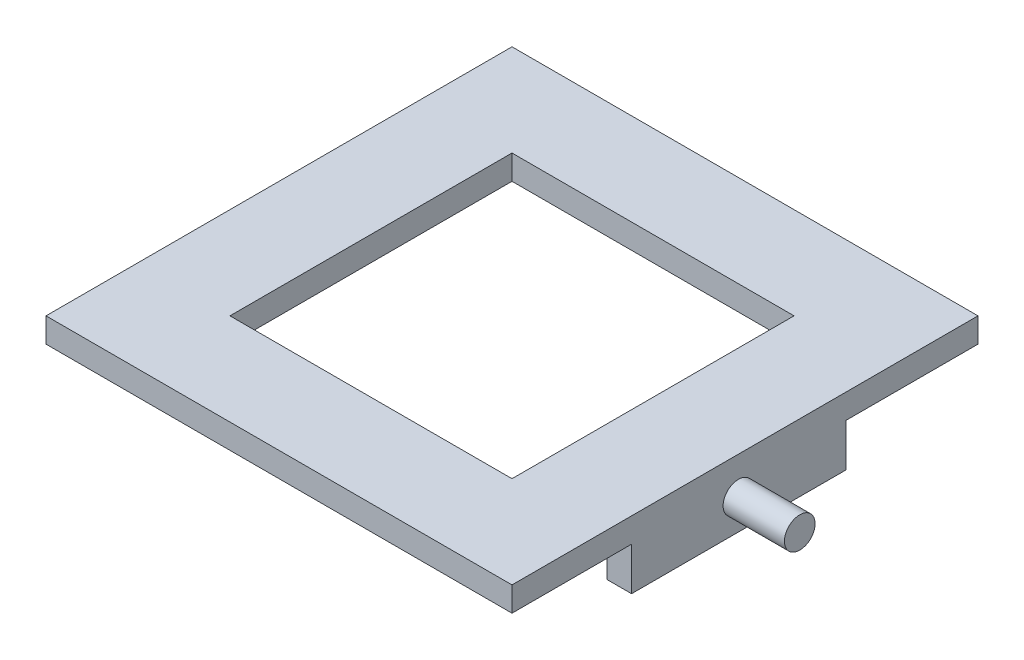
ISO-10303-21;
HEADER;
FILE_DESCRIPTION(('STEP AP214'),'2;1');
FILE_NAME('part.step','',(''),(''),'','','');
FILE_SCHEMA(('AUTOMOTIVE_DESIGN { 1 0 10303 214 1 1 1 1 }'));
ENDSEC;
DATA;
#1=APPLICATION_CONTEXT('core data for automotive mechanical design processes');
#2=APPLICATION_PROTOCOL_DEFINITION('international standard','automotive_design',2000,#1);
#3=PRODUCT_CONTEXT('',#1,'mechanical');
#4=PRODUCT('Part','Part','',(#3));
#5=PRODUCT_RELATED_PRODUCT_CATEGORY('part','',(#4));
#6=PRODUCT_DEFINITION_FORMATION('','',#4);
#7=PRODUCT_DEFINITION_CONTEXT('part definition',#1,'design');
#8=PRODUCT_DEFINITION('design','',#6,#7);
#9=PRODUCT_DEFINITION_SHAPE('','',#8);
#10=(LENGTH_UNIT() NAMED_UNIT(*) SI_UNIT(.MILLI.,.METRE.));
#11=(NAMED_UNIT(*) PLANE_ANGLE_UNIT() SI_UNIT($,.RADIAN.));
#12=(NAMED_UNIT(*) SI_UNIT($,.STERADIAN.) SOLID_ANGLE_UNIT());
#13=UNCERTAINTY_MEASURE_WITH_UNIT(LENGTH_MEASURE(1.E-05),#10,'distance_accuracy_value','');
#14=(GEOMETRIC_REPRESENTATION_CONTEXT(3) GLOBAL_UNCERTAINTY_ASSIGNED_CONTEXT((#13)) GLOBAL_UNIT_ASSIGNED_CONTEXT((#10,
#11,#12)) REPRESENTATION_CONTEXT('',''));
#15=CARTESIAN_POINT('',(0.,0.,0.));
#16=DIRECTION('',(0.,0.,1.));
#17=DIRECTION('',(1.,0.,0.));
#18=AXIS2_PLACEMENT_3D('',#15,#16,#17);
#19=CARTESIAN_POINT('',(0.,4.,0.));
#20=DIRECTION('',(0.,-1.,0.));
#21=DIRECTION('',(0.,0.,-1.));
#22=AXIS2_PLACEMENT_3D('',#19,#20,#21);
#23=PLANE('',#22);
#24=DIRECTION('',(0.,0.,-1.));
#25=VECTOR('',#24,1.);
#26=CARTESIAN_POINT('',(76.,4.,0.));
#27=LINE('',#26,#25);
#28=CARTESIAN_POINT('',(76.,4.,0.));
#29=VERTEX_POINT('',#28);
#30=CARTESIAN_POINT('',(76.,4.,-76.));
#31=VERTEX_POINT('',#30);
#32=EDGE_CURVE('E250',#29,#31,#27,.T.);
#33=ORIENTED_EDGE('',*,*,#32,.T.);
#34=DIRECTION('',(-1.,0.,0.));
#35=VECTOR('',#34,1.);
#36=CARTESIAN_POINT('',(0.,4.,-76.));
#37=LINE('',#36,#35);
#38=CARTESIAN_POINT('',(0.,4.,-76.));
#39=VERTEX_POINT('',#38);
#40=EDGE_CURVE('E252',#31,#39,#37,.T.);
#41=ORIENTED_EDGE('',*,*,#40,.T.);
#42=DIRECTION('',(0.,0.,1.));
#43=VECTOR('',#42,1.);
#44=CARTESIAN_POINT('',(0.,4.,0.));
#45=LINE('',#44,#43);
#46=CARTESIAN_POINT('',(0.,4.,0.));
#47=VERTEX_POINT('',#46);
#48=EDGE_CURVE('E245',#39,#47,#45,.T.);
#49=ORIENTED_EDGE('',*,*,#48,.T.);
#50=DIRECTION('',(1.,0.,0.));
#51=VECTOR('',#50,1.);
#52=CARTESIAN_POINT('',(0.,4.,0.));
#53=LINE('',#52,#51);
#54=EDGE_CURVE('E247',#47,#29,#53,.T.);
#55=ORIENTED_EDGE('',*,*,#54,.T.);
#56=EDGE_LOOP('',(#33,#41,#49,#55));
#57=FACE_BOUND('',#56,.T.);
#58=DIRECTION('',(1.,0.,0.));
#59=VECTOR('',#58,1.);
#60=CARTESIAN_POINT('',(15.,4.,-15.));
#61=LINE('',#60,#59);
#62=CARTESIAN_POINT('',(15.,4.,-15.));
#63=VERTEX_POINT('',#62);
#64=CARTESIAN_POINT('',(61.,4.,-15.));
#65=VERTEX_POINT('',#64);
#66=EDGE_CURVE('E214',#63,#65,#61,.T.);
#67=ORIENTED_EDGE('',*,*,#66,.F.);
#68=DIRECTION('',(0.,0.,1.));
#69=VECTOR('',#68,1.);
#70=CARTESIAN_POINT('',(15.,4.,-15.));
#71=LINE('',#70,#69);
#72=CARTESIAN_POINT('',(15.,4.,-61.));
#73=VERTEX_POINT('',#72);
#74=EDGE_CURVE('E222',#73,#63,#71,.T.);
#75=ORIENTED_EDGE('',*,*,#74,.F.);
#76=DIRECTION('',(-1.,0.,0.));
#77=VECTOR('',#76,1.);
#78=CARTESIAN_POINT('',(15.,4.,-61.));
#79=LINE('',#78,#77);
#80=CARTESIAN_POINT('',(61.,4.,-61.));
#81=VERTEX_POINT('',#80);
#82=EDGE_CURVE('E219',#81,#73,#79,.T.);
#83=ORIENTED_EDGE('',*,*,#82,.F.);
#84=DIRECTION('',(0.,0.,-1.));
#85=VECTOR('',#84,1.);
#86=CARTESIAN_POINT('',(61.,4.,-15.));
#87=LINE('',#86,#85);
#88=EDGE_CURVE('E216',#65,#81,#87,.T.);
#89=ORIENTED_EDGE('',*,*,#88,.F.);
#90=EDGE_LOOP('',(#67,#75,#83,#89));
#91=FACE_BOUND('',#90,.T.);
#92=ADVANCED_FACE('F35',(#57,#91),#23,.F.);
#93=CARTESIAN_POINT('',(0.,0.,0.));
#94=DIRECTION('',(0.,-1.,0.));
#95=DIRECTION('',(0.,0.,-1.));
#96=AXIS2_PLACEMENT_3D('',#93,#94,#95);
#97=PLANE('',#96);
#98=DIRECTION('',(-1.,0.,0.));
#99=VECTOR('',#98,1.);
#100=CARTESIAN_POINT('',(0.,0.,-19.5));
#101=LINE('',#100,#99);
#102=CARTESIAN_POINT('',(76.,0.,-19.5));
#103=VERTEX_POINT('',#102);
#104=CARTESIAN_POINT('',(72.,0.,-19.5));
#105=VERTEX_POINT('',#104);
#106=EDGE_CURVE('E156',#103,#105,#101,.T.);
#107=ORIENTED_EDGE('',*,*,#106,.F.);
#108=DIRECTION('',(0.,0.,-1.));
#109=VECTOR('',#108,1.);
#110=CARTESIAN_POINT('',(76.,0.,0.));
#111=LINE('',#110,#109);
#112=CARTESIAN_POINT('',(76.,0.,0.));
#113=VERTEX_POINT('',#112);
#114=EDGE_CURVE('E261',#113,#103,#111,.T.);
#115=ORIENTED_EDGE('',*,*,#114,.F.);
#116=DIRECTION('',(1.,0.,0.));
#117=VECTOR('',#116,1.);
#118=CARTESIAN_POINT('',(0.,0.,0.));
#119=LINE('',#118,#117);
#120=CARTESIAN_POINT('',(0.,0.,0.));
#121=VERTEX_POINT('',#120);
#122=EDGE_CURVE('E258',#121,#113,#119,.T.);
#123=ORIENTED_EDGE('',*,*,#122,.F.);
#124=DIRECTION('',(0.,0.,1.));
#125=VECTOR('',#124,1.);
#126=CARTESIAN_POINT('',(0.,0.,0.));
#127=LINE('',#126,#125);
#128=CARTESIAN_POINT('',(0.,0.,-19.5));
#129=VERTEX_POINT('',#128);
#130=EDGE_CURVE('E244',#129,#121,#127,.T.);
#131=ORIENTED_EDGE('',*,*,#130,.F.);
#132=DIRECTION('',(-1.,0.,0.));
#133=VECTOR('',#132,1.);
#134=CARTESIAN_POINT('',(0.,0.,-19.5));
#135=LINE('',#134,#133);
#136=CARTESIAN_POINT('',(4.,0.,-19.5));
#137=VERTEX_POINT('',#136);
#138=EDGE_CURVE('E207',#137,#129,#135,.T.);
#139=ORIENTED_EDGE('',*,*,#138,.F.);
#140=DIRECTION('',(0.,0.,-1.));
#141=VECTOR('',#140,1.);
#142=CARTESIAN_POINT('',(4.,0.,0.));
#143=LINE('',#142,#141);
#144=CARTESIAN_POINT('',(4.,0.,-54.5));
#145=VERTEX_POINT('',#144);
#146=EDGE_CURVE('E276',#137,#145,#143,.T.);
#147=ORIENTED_EDGE('',*,*,#146,.T.);
#148=DIRECTION('',(1.,0.,0.));
#149=VECTOR('',#148,1.);
#150=CARTESIAN_POINT('',(0.,0.,-54.5));
#151=LINE('',#150,#149);
#152=CARTESIAN_POINT('',(0.,0.,-54.5));
#153=VERTEX_POINT('',#152);
#154=EDGE_CURVE('E211',#153,#145,#151,.T.);
#155=ORIENTED_EDGE('',*,*,#154,.F.);
#156=CARTESIAN_POINT('',(0.,0.,-76.));
#157=VERTEX_POINT('',#156);
#158=EDGE_CURVE('E255',#157,#153,#127,.T.);
#159=ORIENTED_EDGE('',*,*,#158,.F.);
#160=DIRECTION('',(-1.,0.,0.));
#161=VECTOR('',#160,1.);
#162=CARTESIAN_POINT('',(0.,0.,-76.));
#163=LINE('',#162,#161);
#164=CARTESIAN_POINT('',(76.,0.,-76.));
#165=VERTEX_POINT('',#164);
#166=EDGE_CURVE('E248',#165,#157,#163,.T.);
#167=ORIENTED_EDGE('',*,*,#166,.F.);
#168=CARTESIAN_POINT('',(76.,0.,-54.5));
#169=VERTEX_POINT('',#168);
#170=EDGE_CURVE('E260',#169,#165,#111,.T.);
#171=ORIENTED_EDGE('',*,*,#170,.F.);
#172=DIRECTION('',(1.,0.,0.));
#173=VECTOR('',#172,1.);
#174=CARTESIAN_POINT('',(0.,0.,-54.5));
#175=LINE('',#174,#173);
#176=CARTESIAN_POINT('',(72.,0.,-54.5));
#177=VERTEX_POINT('',#176);
#178=EDGE_CURVE('E181',#177,#169,#175,.T.);
#179=ORIENTED_EDGE('',*,*,#178,.F.);
#180=DIRECTION('',(0.,0.,-1.));
#181=VECTOR('',#180,1.);
#182=CARTESIAN_POINT('',(72.,0.,0.));
#183=LINE('',#182,#181);
#184=EDGE_CURVE('E43',#105,#177,#183,.T.);
#185=ORIENTED_EDGE('',*,*,#184,.F.);
#186=EDGE_LOOP('',(#107,#115,#123,#131,#139,#147,#155,#159,#167,#171,#179,#185));
#187=FACE_BOUND('',#186,.T.);
#188=DIRECTION('',(0.,0.,1.));
#189=VECTOR('',#188,1.);
#190=CARTESIAN_POINT('',(15.,0.,-15.));
#191=LINE('',#190,#189);
#192=CARTESIAN_POINT('',(15.,0.,-61.));
#193=VERTEX_POINT('',#192);
#194=CARTESIAN_POINT('',(15.,0.,-15.));
#195=VERTEX_POINT('',#194);
#196=EDGE_CURVE('E217',#193,#195,#191,.T.);
#197=ORIENTED_EDGE('',*,*,#196,.T.);
#198=DIRECTION('',(1.,0.,0.));
#199=VECTOR('',#198,1.);
#200=CARTESIAN_POINT('',(15.,0.,-15.));
#201=LINE('',#200,#199);
#202=CARTESIAN_POINT('',(61.,0.,-15.));
#203=VERTEX_POINT('',#202);
#204=EDGE_CURVE('E213',#195,#203,#201,.T.);
#205=ORIENTED_EDGE('',*,*,#204,.T.);
#206=DIRECTION('',(0.,0.,-1.));
#207=VECTOR('',#206,1.);
#208=CARTESIAN_POINT('',(61.,0.,-15.));
#209=LINE('',#208,#207);
#210=CARTESIAN_POINT('',(61.,0.,-61.));
#211=VERTEX_POINT('',#210);
#212=EDGE_CURVE('E227',#203,#211,#209,.T.);
#213=ORIENTED_EDGE('',*,*,#212,.T.);
#214=DIRECTION('',(-1.,0.,0.));
#215=VECTOR('',#214,1.);
#216=CARTESIAN_POINT('',(15.,0.,-61.));
#217=LINE('',#216,#215);
#218=EDGE_CURVE('E230',#211,#193,#217,.T.);
#219=ORIENTED_EDGE('',*,*,#218,.T.);
#220=EDGE_LOOP('',(#197,#205,#213,#219));
#221=FACE_BOUND('',#220,.T.);
#222=ADVANCED_FACE('F289',(#187,#221),#97,.T.);
#223=CARTESIAN_POINT('',(0.,4.,0.));
#224=DIRECTION('',(1.,0.,0.));
#225=DIRECTION('',(0.,0.,-1.));
#226=AXIS2_PLACEMENT_3D('',#223,#224,#225);
#227=PLANE('',#226);
#228=CARTESIAN_POINT('',(0.,-2.05999999999999,-22.55));
#229=DIRECTION('',(1.,0.,0.));
#230=DIRECTION('',(0.,0.,-1.));
#231=AXIS2_PLACEMENT_3D('',#228,#229,#230);
#232=CIRCLE('',#231,0.6);
#233=CARTESIAN_POINT('',(0.,-2.05999999999999,-23.15));
#234=VERTEX_POINT('',#233);
#235=EDGE_CURVE('E282',#234,#234,#232,.F.);
#236=ORIENTED_EDGE('',*,*,#235,.F.);
#237=EDGE_LOOP('',(#236));
#238=FACE_BOUND('',#237,.T.);
#239=CARTESIAN_POINT('',(0.,-2.06,-51.45));
#240=DIRECTION('',(1.,0.,0.));
#241=DIRECTION('',(0.,0.,-1.));
#242=AXIS2_PLACEMENT_3D('',#239,#240,#241);
#243=CIRCLE('',#242,0.600000000000001);
#244=CARTESIAN_POINT('',(0.,-2.06,-52.05));
#245=VERTEX_POINT('',#244);
#246=EDGE_CURVE('E279',#245,#245,#243,.F.);
#247=ORIENTED_EDGE('',*,*,#246,.F.);
#248=EDGE_LOOP('',(#247));
#249=FACE_BOUND('',#248,.T.);
#250=DIRECTION('',(0.,-1.,0.));
#251=VECTOR('',#250,1.);
#252=CARTESIAN_POINT('',(0.,4.,0.));
#253=LINE('',#252,#251);
#254=EDGE_CURVE('E273',#47,#121,#253,.T.);
#255=ORIENTED_EDGE('',*,*,#254,.F.);
#256=ORIENTED_EDGE('',*,*,#48,.F.);
#257=DIRECTION('',(0.,-1.,0.));
#258=VECTOR('',#257,1.);
#259=CARTESIAN_POINT('',(0.,4.,-76.));
#260=LINE('',#259,#258);
#261=EDGE_CURVE('E254',#39,#157,#260,.T.);
#262=ORIENTED_EDGE('',*,*,#261,.T.);
#263=ORIENTED_EDGE('',*,*,#158,.T.);
#264=DIRECTION('',(0.,-1.,0.));
#265=VECTOR('',#264,1.);
#266=CARTESIAN_POINT('',(0.,4.,-54.5));
#267=LINE('',#266,#265);
#268=CARTESIAN_POINT('',(0.,-7.,-54.5));
#269=VERTEX_POINT('',#268);
#270=EDGE_CURVE('E191',#153,#269,#267,.T.);
#271=ORIENTED_EDGE('',*,*,#270,.T.);
#272=DIRECTION('',(0.,0.,1.));
#273=VECTOR('',#272,1.);
#274=CARTESIAN_POINT('',(0.,-7.,-54.5));
#275=LINE('',#274,#273);
#276=CARTESIAN_POINT('',(0.,-7.,-19.5));
#277=VERTEX_POINT('',#276);
#278=EDGE_CURVE('E202',#269,#277,#275,.T.);
#279=ORIENTED_EDGE('',*,*,#278,.T.);
#280=DIRECTION('',(0.,1.,0.));
#281=VECTOR('',#280,1.);
#282=CARTESIAN_POINT('',(0.,4.,-19.5));
#283=LINE('',#282,#281);
#284=EDGE_CURVE('E58',#277,#129,#283,.T.);
#285=ORIENTED_EDGE('',*,*,#284,.T.);
#286=ORIENTED_EDGE('',*,*,#130,.T.);
#287=EDGE_LOOP('',(#255,#256,#262,#263,#271,#279,#285,#286));
#288=FACE_BOUND('',#287,.T.);
#289=ADVANCED_FACE('F37',(#238,#249,#288),#227,.F.);
#290=CARTESIAN_POINT('',(0.,4.,0.));
#291=DIRECTION('',(0.,0.,-1.));
#292=DIRECTION('',(-1.,0.,0.));
#293=AXIS2_PLACEMENT_3D('',#290,#291,#292);
#294=PLANE('',#293);
#295=ORIENTED_EDGE('',*,*,#122,.T.);
#296=DIRECTION('',(0.,-1.,0.));
#297=VECTOR('',#296,1.);
#298=CARTESIAN_POINT('',(76.,4.,0.));
#299=LINE('',#298,#297);
#300=EDGE_CURVE('E270',#29,#113,#299,.T.);
#301=ORIENTED_EDGE('',*,*,#300,.F.);
#302=ORIENTED_EDGE('',*,*,#54,.F.);
#303=ORIENTED_EDGE('',*,*,#254,.T.);
#304=EDGE_LOOP('',(#295,#301,#302,#303));
#305=FACE_BOUND('',#304,.T.);
#306=ADVANCED_FACE('F311',(#305),#294,.F.);
#307=CARTESIAN_POINT('',(76.,4.,0.));
#308=DIRECTION('',(-1.,0.,0.));
#309=DIRECTION('',(0.,0.,1.));
#310=AXIS2_PLACEMENT_3D('',#307,#308,#309);
#311=PLANE('',#310);
#312=CARTESIAN_POINT('',(76.,-2.06,-36.93));
#313=DIRECTION('',(-1.,0.,0.));
#314=DIRECTION('',(0.,0.,1.));
#315=AXIS2_PLACEMENT_3D('',#312,#313,#314);
#316=CIRCLE('',#315,2.5);
#317=CARTESIAN_POINT('',(76.,-2.06,-34.43));
#318=VERTEX_POINT('',#317);
#319=EDGE_CURVE('E11',#318,#318,#316,.F.);
#320=ORIENTED_EDGE('',*,*,#319,.F.);
#321=EDGE_LOOP('',(#320));
#322=FACE_BOUND('',#321,.T.);
#323=DIRECTION('',(0.,-1.,0.));
#324=VECTOR('',#323,1.);
#325=CARTESIAN_POINT('',(76.,4.,-76.));
#326=LINE('',#325,#324);
#327=EDGE_CURVE('E267',#31,#165,#326,.T.);
#328=ORIENTED_EDGE('',*,*,#327,.F.);
#329=ORIENTED_EDGE('',*,*,#32,.F.);
#330=ORIENTED_EDGE('',*,*,#300,.T.);
#331=ORIENTED_EDGE('',*,*,#114,.T.);
#332=DIRECTION('',(0.,-1.,0.));
#333=VECTOR('',#332,1.);
#334=CARTESIAN_POINT('',(76.,-7.,-19.5));
#335=LINE('',#334,#333);
#336=CARTESIAN_POINT('',(76.,-7.,-19.5));
#337=VERTEX_POINT('',#336);
#338=EDGE_CURVE('E176',#103,#337,#335,.T.);
#339=ORIENTED_EDGE('',*,*,#338,.T.);
#340=DIRECTION('',(0.,0.,-1.));
#341=VECTOR('',#340,1.);
#342=CARTESIAN_POINT('',(76.,-7.,-19.5));
#343=LINE('',#342,#341);
#344=CARTESIAN_POINT('',(76.,-7.,-54.5));
#345=VERTEX_POINT('',#344);
#346=EDGE_CURVE('E165',#337,#345,#343,.T.);
#347=ORIENTED_EDGE('',*,*,#346,.T.);
#348=DIRECTION('',(0.,1.,0.));
#349=VECTOR('',#348,1.);
#350=CARTESIAN_POINT('',(76.,-7.,-54.5));
#351=LINE('',#350,#349);
#352=EDGE_CURVE('E50',#345,#169,#351,.T.);
#353=ORIENTED_EDGE('',*,*,#352,.T.);
#354=ORIENTED_EDGE('',*,*,#170,.T.);
#355=EDGE_LOOP('',(#328,#329,#330,#331,#339,#347,#353,#354));
#356=FACE_BOUND('',#355,.T.);
#357=ADVANCED_FACE('F294',(#322,#356),#311,.F.);
#358=CARTESIAN_POINT('',(0.,4.,-76.));
#359=DIRECTION('',(0.,0.,1.));
#360=DIRECTION('',(1.,0.,0.));
#361=AXIS2_PLACEMENT_3D('',#358,#359,#360);
#362=PLANE('',#361);
#363=ORIENTED_EDGE('',*,*,#166,.T.);
#364=ORIENTED_EDGE('',*,*,#261,.F.);
#365=ORIENTED_EDGE('',*,*,#40,.F.);
#366=ORIENTED_EDGE('',*,*,#327,.T.);
#367=EDGE_LOOP('',(#363,#364,#365,#366));
#368=FACE_BOUND('',#367,.T.);
#369=ADVANCED_FACE('F298',(#368),#362,.F.);
#370=CARTESIAN_POINT('',(15.,4.,-15.));
#371=DIRECTION('',(0.,0.,-1.));
#372=DIRECTION('',(-1.,0.,0.));
#373=AXIS2_PLACEMENT_3D('',#370,#371,#372);
#374=PLANE('',#373);
#375=ORIENTED_EDGE('',*,*,#204,.F.);
#376=DIRECTION('',(0.,-1.,0.));
#377=VECTOR('',#376,1.);
#378=CARTESIAN_POINT('',(15.,4.,-15.));
#379=LINE('',#378,#377);
#380=EDGE_CURVE('E224',#63,#195,#379,.T.);
#381=ORIENTED_EDGE('',*,*,#380,.F.);
#382=ORIENTED_EDGE('',*,*,#66,.T.);
#383=DIRECTION('',(0.,-1.,0.));
#384=VECTOR('',#383,1.);
#385=CARTESIAN_POINT('',(61.,4.,-15.));
#386=LINE('',#385,#384);
#387=EDGE_CURVE('E241',#65,#203,#386,.T.);
#388=ORIENTED_EDGE('',*,*,#387,.T.);
#389=EDGE_LOOP('',(#375,#381,#382,#388));
#390=FACE_BOUND('',#389,.T.);
#391=ADVANCED_FACE('F343',(#390),#374,.T.);
#392=CARTESIAN_POINT('',(61.,4.,-15.));
#393=DIRECTION('',(-1.,0.,0.));
#394=DIRECTION('',(0.,0.,1.));
#395=AXIS2_PLACEMENT_3D('',#392,#393,#394);
#396=PLANE('',#395);
#397=ORIENTED_EDGE('',*,*,#212,.F.);
#398=ORIENTED_EDGE('',*,*,#387,.F.);
#399=ORIENTED_EDGE('',*,*,#88,.T.);
#400=DIRECTION('',(0.,-1.,0.));
#401=VECTOR('',#400,1.);
#402=CARTESIAN_POINT('',(61.,4.,-61.));
#403=LINE('',#402,#401);
#404=EDGE_CURVE('E239',#81,#211,#403,.T.);
#405=ORIENTED_EDGE('',*,*,#404,.T.);
#406=EDGE_LOOP('',(#397,#398,#399,#405));
#407=FACE_BOUND('',#406,.T.);
#408=ADVANCED_FACE('F488',(#407),#396,.T.);
#409=CARTESIAN_POINT('',(15.,4.,-61.));
#410=DIRECTION('',(0.,0.,1.));
#411=DIRECTION('',(1.,0.,0.));
#412=AXIS2_PLACEMENT_3D('',#409,#410,#411);
#413=PLANE('',#412);
#414=ORIENTED_EDGE('',*,*,#218,.F.);
#415=ORIENTED_EDGE('',*,*,#404,.F.);
#416=ORIENTED_EDGE('',*,*,#82,.T.);
#417=DIRECTION('',(0.,-1.,0.));
#418=VECTOR('',#417,1.);
#419=CARTESIAN_POINT('',(15.,4.,-61.));
#420=LINE('',#419,#418);
#421=EDGE_CURVE('E237',#73,#193,#420,.T.);
#422=ORIENTED_EDGE('',*,*,#421,.T.);
#423=EDGE_LOOP('',(#414,#415,#416,#422));
#424=FACE_BOUND('',#423,.T.);
#425=ADVANCED_FACE('F478',(#424),#413,.T.);
#426=CARTESIAN_POINT('',(15.,4.,-15.));
#427=DIRECTION('',(1.,0.,0.));
#428=DIRECTION('',(0.,0.,-1.));
#429=AXIS2_PLACEMENT_3D('',#426,#427,#428);
#430=PLANE('',#429);
#431=ORIENTED_EDGE('',*,*,#196,.F.);
#432=ORIENTED_EDGE('',*,*,#421,.F.);
#433=ORIENTED_EDGE('',*,*,#74,.T.);
#434=ORIENTED_EDGE('',*,*,#380,.T.);
#435=EDGE_LOOP('',(#431,#432,#433,#434));
#436=FACE_BOUND('',#435,.T.);
#437=ADVANCED_FACE('F333',(#436),#430,.T.);
#438=CARTESIAN_POINT('',(4.,4.,-54.5));
#439=DIRECTION('',(0.,0.,-1.));
#440=DIRECTION('',(-1.,0.,0.));
#441=AXIS2_PLACEMENT_3D('',#438,#439,#440);
#442=PLANE('',#441);
#443=ORIENTED_EDGE('',*,*,#270,.F.);
#444=ORIENTED_EDGE('',*,*,#154,.T.);
#445=DIRECTION('',(0.,-1.,0.));
#446=VECTOR('',#445,1.);
#447=CARTESIAN_POINT('',(4.,4.,-54.5));
#448=LINE('',#447,#446);
#449=CARTESIAN_POINT('',(4.,-7.,-54.5));
#450=VERTEX_POINT('',#449);
#451=EDGE_CURVE('E192',#145,#450,#448,.T.);
#452=ORIENTED_EDGE('',*,*,#451,.T.);
#453=DIRECTION('',(-1.,0.,0.));
#454=VECTOR('',#453,1.);
#455=CARTESIAN_POINT('',(4.,-7.,-54.5));
#456=LINE('',#455,#454);
#457=EDGE_CURVE('E200',#450,#269,#456,.T.);
#458=ORIENTED_EDGE('',*,*,#457,.T.);
#459=EDGE_LOOP('',(#443,#444,#452,#458));
#460=FACE_BOUND('',#459,.T.);
#461=ADVANCED_FACE('F315',(#460),#442,.T.);
#462=CARTESIAN_POINT('',(4.,4.,-19.5));
#463=DIRECTION('',(0.,0.,1.));
#464=DIRECTION('',(1.,0.,0.));
#465=AXIS2_PLACEMENT_3D('',#462,#463,#464);
#466=PLANE('',#465);
#467=DIRECTION('',(0.,1.,0.));
#468=VECTOR('',#467,1.);
#469=CARTESIAN_POINT('',(4.,4.,-19.5));
#470=LINE('',#469,#468);
#471=CARTESIAN_POINT('',(4.,-7.,-19.5));
#472=VERTEX_POINT('',#471);
#473=EDGE_CURVE('E197',#472,#137,#470,.T.);
#474=ORIENTED_EDGE('',*,*,#473,.T.);
#475=ORIENTED_EDGE('',*,*,#138,.T.);
#476=ORIENTED_EDGE('',*,*,#284,.F.);
#477=DIRECTION('',(-1.,0.,0.));
#478=VECTOR('',#477,1.);
#479=CARTESIAN_POINT('',(4.,-7.,-19.5));
#480=LINE('',#479,#478);
#481=EDGE_CURVE('E205',#472,#277,#480,.T.);
#482=ORIENTED_EDGE('',*,*,#481,.F.);
#483=EDGE_LOOP('',(#474,#475,#476,#482));
#484=FACE_BOUND('',#483,.T.);
#485=ADVANCED_FACE('F325',(#484),#466,.T.);
#486=CARTESIAN_POINT('',(4.,-7.,-54.5));
#487=DIRECTION('',(0.,-1.,0.));
#488=DIRECTION('',(0.,0.,-1.));
#489=AXIS2_PLACEMENT_3D('',#486,#487,#488);
#490=PLANE('',#489);
#491=ORIENTED_EDGE('',*,*,#278,.F.);
#492=ORIENTED_EDGE('',*,*,#457,.F.);
#493=DIRECTION('',(0.,0.,1.));
#494=VECTOR('',#493,1.);
#495=CARTESIAN_POINT('',(4.,-7.,-54.5));
#496=LINE('',#495,#494);
#497=EDGE_CURVE('E194',#450,#472,#496,.T.);
#498=ORIENTED_EDGE('',*,*,#497,.T.);
#499=ORIENTED_EDGE('',*,*,#481,.T.);
#500=EDGE_LOOP('',(#491,#492,#498,#499));
#501=FACE_BOUND('',#500,.T.);
#502=ADVANCED_FACE('F323',(#501),#490,.T.);
#503=CARTESIAN_POINT('',(4.,0.,0.));
#504=DIRECTION('',(-1.,0.,0.));
#505=DIRECTION('',(0.,0.,1.));
#506=AXIS2_PLACEMENT_3D('',#503,#504,#505);
#507=PLANE('',#506);
#508=ORIENTED_EDGE('',*,*,#146,.F.);
#509=ORIENTED_EDGE('',*,*,#473,.F.);
#510=ORIENTED_EDGE('',*,*,#497,.F.);
#511=ORIENTED_EDGE('',*,*,#451,.F.);
#512=EDGE_LOOP('',(#508,#509,#510,#511));
#513=FACE_BOUND('',#512,.T.);
#514=ADVANCED_FACE('F319',(#513),#507,.F.);
#515=CARTESIAN_POINT('',(-2.,-2.06,-51.45));
#516=DIRECTION('',(1.,0.,0.));
#517=DIRECTION('',(0.,0.,-1.));
#518=AXIS2_PLACEMENT_3D('',#515,#516,#517);
#519=CYLINDRICAL_SURFACE('',#518,0.600000000000001);
#520=CARTESIAN_POINT('',(-2.,-2.06,-51.45));
#521=DIRECTION('',(-1.,0.,0.));
#522=DIRECTION('',(0.,0.,1.));
#523=AXIS2_PLACEMENT_3D('',#520,#521,#522);
#524=CIRCLE('',#523,0.600000000000001);
#525=CARTESIAN_POINT('',(-2.,-2.06,-50.85));
#526=VERTEX_POINT('',#525);
#527=EDGE_CURVE('E188',#526,#526,#524,.T.);
#528=ORIENTED_EDGE('',*,*,#527,.F.);
#529=EDGE_LOOP('',(#528));
#530=FACE_BOUND('',#529,.T.);
#531=ORIENTED_EDGE('',*,*,#246,.T.);
#532=EDGE_LOOP('',(#531));
#533=FACE_BOUND('',#532,.T.);
#534=ADVANCED_FACE('F361',(#530,#533),#519,.T.);
#535=CARTESIAN_POINT('',(-2.,0.,0.));
#536=DIRECTION('',(-1.,0.,0.));
#537=DIRECTION('',(0.,0.,1.));
#538=AXIS2_PLACEMENT_3D('',#535,#536,#537);
#539=PLANE('',#538);
#540=ORIENTED_EDGE('',*,*,#527,.T.);
#541=EDGE_LOOP('',(#540));
#542=FACE_BOUND('',#541,.T.);
#543=ADVANCED_FACE('F363',(#542),#539,.T.);
#544=CARTESIAN_POINT('',(-2.,-2.05999999999999,-22.55));
#545=DIRECTION('',(1.,0.,0.));
#546=DIRECTION('',(0.,0.,-1.));
#547=AXIS2_PLACEMENT_3D('',#544,#545,#546);
#548=CYLINDRICAL_SURFACE('',#547,0.6);
#549=CARTESIAN_POINT('',(-2.,-2.05999999999999,-22.55));
#550=DIRECTION('',(-1.,0.,0.));
#551=DIRECTION('',(0.,0.,1.));
#552=AXIS2_PLACEMENT_3D('',#549,#550,#551);
#553=CIRCLE('',#552,0.6);
#554=CARTESIAN_POINT('',(-2.,-2.05999999999999,-21.95));
#555=VERTEX_POINT('',#554);
#556=EDGE_CURVE('E185',#555,#555,#553,.T.);
#557=ORIENTED_EDGE('',*,*,#556,.F.);
#558=EDGE_LOOP('',(#557));
#559=FACE_BOUND('',#558,.T.);
#560=ORIENTED_EDGE('',*,*,#235,.T.);
#561=EDGE_LOOP('',(#560));
#562=FACE_BOUND('',#561,.T.);
#563=ADVANCED_FACE('F370',(#559,#562),#548,.T.);
#564=CARTESIAN_POINT('',(-2.,0.,0.));
#565=DIRECTION('',(-1.,0.,0.));
#566=DIRECTION('',(0.,0.,1.));
#567=AXIS2_PLACEMENT_3D('',#564,#565,#566);
#568=PLANE('',#567);
#569=ORIENTED_EDGE('',*,*,#556,.T.);
#570=EDGE_LOOP('',(#569));
#571=FACE_BOUND('',#570,.T.);
#572=ADVANCED_FACE('F377',(#571),#568,.T.);
#573=CARTESIAN_POINT('',(72.,-7.,-19.5));
#574=DIRECTION('',(0.,0.,1.));
#575=DIRECTION('',(1.,0.,0.));
#576=AXIS2_PLACEMENT_3D('',#573,#574,#575);
#577=PLANE('',#576);
#578=ORIENTED_EDGE('',*,*,#338,.F.);
#579=ORIENTED_EDGE('',*,*,#106,.T.);
#580=DIRECTION('',(0.,-1.,0.));
#581=VECTOR('',#580,1.);
#582=CARTESIAN_POINT('',(72.,-7.,-19.5));
#583=LINE('',#582,#581);
#584=CARTESIAN_POINT('',(72.,-7.,-19.5));
#585=VERTEX_POINT('',#584);
#586=EDGE_CURVE('E150',#105,#585,#583,.T.);
#587=ORIENTED_EDGE('',*,*,#586,.T.);
#588=DIRECTION('',(1.,0.,0.));
#589=VECTOR('',#588,1.);
#590=CARTESIAN_POINT('',(72.,-7.,-19.5));
#591=LINE('',#590,#589);
#592=EDGE_CURVE('E153',#585,#337,#591,.T.);
#593=ORIENTED_EDGE('',*,*,#592,.T.);
#594=EDGE_LOOP('',(#578,#579,#587,#593));
#595=FACE_BOUND('',#594,.T.);
#596=ADVANCED_FACE('F152',(#595),#577,.T.);
#597=CARTESIAN_POINT('',(72.,-7.,-54.5));
#598=DIRECTION('',(0.,0.,-1.));
#599=DIRECTION('',(-1.,0.,0.));
#600=AXIS2_PLACEMENT_3D('',#597,#598,#599);
#601=PLANE('',#600);
#602=DIRECTION('',(0.,1.,0.));
#603=VECTOR('',#602,1.);
#604=CARTESIAN_POINT('',(72.,-7.,-54.5));
#605=LINE('',#604,#603);
#606=CARTESIAN_POINT('',(72.,-7.,-54.5));
#607=VERTEX_POINT('',#606);
#608=EDGE_CURVE('E167',#607,#177,#605,.T.);
#609=ORIENTED_EDGE('',*,*,#608,.T.);
#610=ORIENTED_EDGE('',*,*,#178,.T.);
#611=ORIENTED_EDGE('',*,*,#352,.F.);
#612=DIRECTION('',(1.,0.,0.));
#613=VECTOR('',#612,1.);
#614=CARTESIAN_POINT('',(72.,-7.,-54.5));
#615=LINE('',#614,#613);
#616=EDGE_CURVE('E166',#607,#345,#615,.T.);
#617=ORIENTED_EDGE('',*,*,#616,.F.);
#618=EDGE_LOOP('',(#609,#610,#611,#617));
#619=FACE_BOUND('',#618,.T.);
#620=ADVANCED_FACE('F287',(#619),#601,.T.);
#621=CARTESIAN_POINT('',(72.,-7.,-19.5));
#622=DIRECTION('',(0.,-1.,0.));
#623=DIRECTION('',(0.,0.,-1.));
#624=AXIS2_PLACEMENT_3D('',#621,#622,#623);
#625=PLANE('',#624);
#626=ORIENTED_EDGE('',*,*,#346,.F.);
#627=ORIENTED_EDGE('',*,*,#592,.F.);
#628=DIRECTION('',(0.,0.,-1.));
#629=VECTOR('',#628,1.);
#630=CARTESIAN_POINT('',(72.,-7.,-19.5));
#631=LINE('',#630,#629);
#632=EDGE_CURVE('E160',#585,#607,#631,.T.);
#633=ORIENTED_EDGE('',*,*,#632,.T.);
#634=ORIENTED_EDGE('',*,*,#616,.T.);
#635=EDGE_LOOP('',(#626,#627,#633,#634));
#636=FACE_BOUND('',#635,.T.);
#637=ADVANCED_FACE('F164',(#636),#625,.T.);
#638=CARTESIAN_POINT('',(72.,0.,0.));
#639=DIRECTION('',(-1.,0.,0.));
#640=DIRECTION('',(0.,0.,1.));
#641=AXIS2_PLACEMENT_3D('',#638,#639,#640);
#642=PLANE('',#641);
#643=ORIENTED_EDGE('',*,*,#586,.F.);
#644=ORIENTED_EDGE('',*,*,#184,.T.);
#645=ORIENTED_EDGE('',*,*,#608,.F.);
#646=ORIENTED_EDGE('',*,*,#632,.F.);
#647=EDGE_LOOP('',(#643,#644,#645,#646));
#648=FACE_BOUND('',#647,.T.);
#649=ADVANCED_FACE('F170',(#648),#642,.T.);
#650=CARTESIAN_POINT('',(86.,-2.06,-36.93));
#651=DIRECTION('',(-1.,0.,0.));
#652=DIRECTION('',(0.,0.,1.));
#653=AXIS2_PLACEMENT_3D('',#650,#651,#652);
#654=CYLINDRICAL_SURFACE('',#653,2.5);
#655=CARTESIAN_POINT('',(86.,-2.06,-36.93));
#656=DIRECTION('',(1.,0.,0.));
#657=DIRECTION('',(0.,0.,-1.));
#658=AXIS2_PLACEMENT_3D('',#655,#656,#657);
#659=CIRCLE('',#658,2.5);
#660=CARTESIAN_POINT('',(86.,-2.06,-39.43));
#661=VERTEX_POINT('',#660);
#662=EDGE_CURVE('E178',#661,#661,#659,.T.);
#663=ORIENTED_EDGE('',*,*,#662,.F.);
#664=EDGE_LOOP('',(#663));
#665=FACE_BOUND('',#664,.T.);
#666=ORIENTED_EDGE('',*,*,#319,.T.);
#667=EDGE_LOOP('',(#666));
#668=FACE_BOUND('',#667,.T.);
#669=ADVANCED_FACE('F390',(#665,#668),#654,.T.);
#670=CARTESIAN_POINT('',(86.,-2.06,-36.93));
#671=DIRECTION('',(1.,0.,0.));
#672=DIRECTION('',(0.,0.,-1.));
#673=AXIS2_PLACEMENT_3D('',#670,#671,#672);
#674=PLANE('',#673);
#675=ORIENTED_EDGE('',*,*,#662,.T.);
#676=EDGE_LOOP('',(#675));
#677=FACE_BOUND('',#676,.T.);
#678=ADVANCED_FACE('F393',(#677),#674,.T.);
#679=CLOSED_SHELL('',(#92,#222,#289,#306,#357,#369,#391,#408,#425,#437,#461,#485,#502,#514,#534,
#543,#563,#572,#596,#620,#637,#649,#669,#678));
#680=MANIFOLD_SOLID_BREP('B2',#679);
#681=ADVANCED_BREP_SHAPE_REPRESENTATION('',(#18,#680),#14);
#682=SHAPE_DEFINITION_REPRESENTATION(#9,#681);
ENDSEC;
END-ISO-10303-21;
